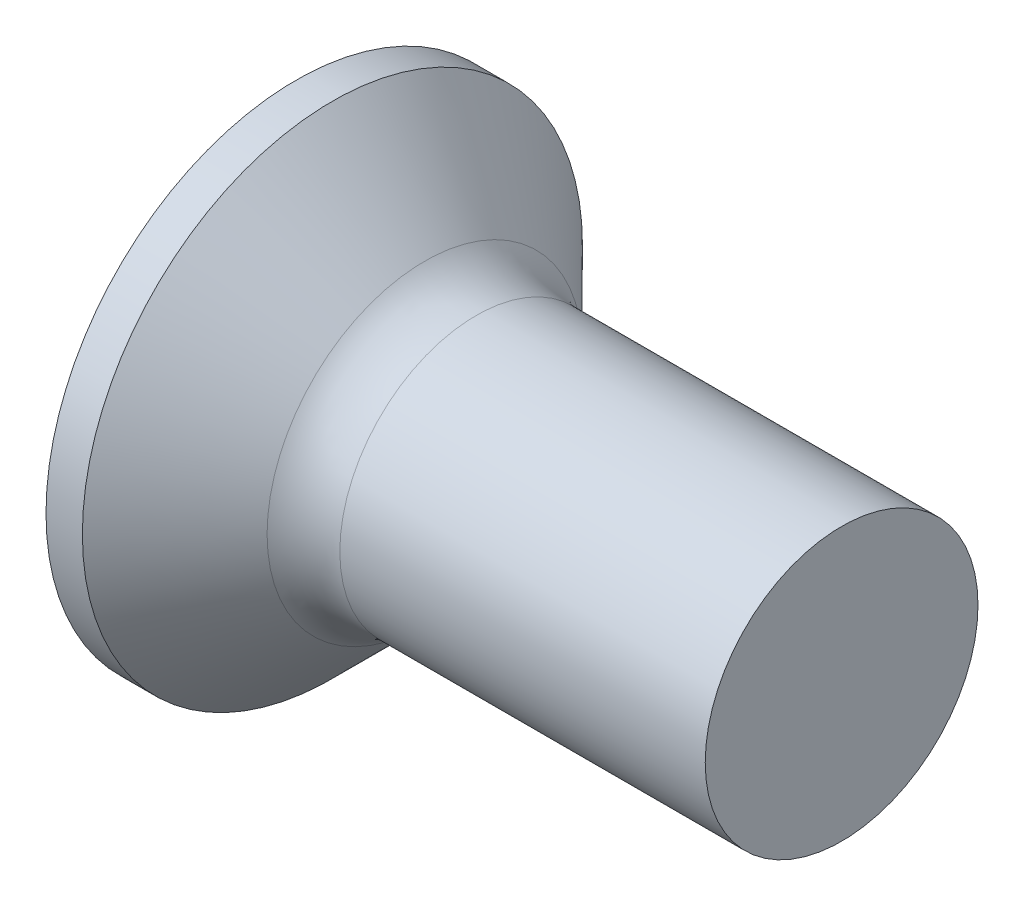
ISO-10303-21;
HEADER;
FILE_DESCRIPTION(('STEP AP214'),'2;1');
FILE_NAME('part.step','',(''),(''),'','','');
FILE_SCHEMA(('AUTOMOTIVE_DESIGN { 1 0 10303 214 1 1 1 1 }'));
ENDSEC;
DATA;
#1=APPLICATION_CONTEXT('core data for automotive mechanical design processes');
#2=APPLICATION_PROTOCOL_DEFINITION('international standard','automotive_design',2000,#1);
#3=PRODUCT_CONTEXT('',#1,'mechanical');
#4=PRODUCT('Part','Part','',(#3));
#5=PRODUCT_RELATED_PRODUCT_CATEGORY('part','',(#4));
#6=PRODUCT_DEFINITION_FORMATION('','',#4);
#7=PRODUCT_DEFINITION_CONTEXT('part definition',#1,'design');
#8=PRODUCT_DEFINITION('design','',#6,#7);
#9=PRODUCT_DEFINITION_SHAPE('','',#8);
#10=(LENGTH_UNIT() NAMED_UNIT(*) SI_UNIT(.MILLI.,.METRE.));
#11=(NAMED_UNIT(*) PLANE_ANGLE_UNIT() SI_UNIT($,.RADIAN.));
#12=(NAMED_UNIT(*) SI_UNIT($,.STERADIAN.) SOLID_ANGLE_UNIT());
#13=UNCERTAINTY_MEASURE_WITH_UNIT(LENGTH_MEASURE(1.E-05),#10,'distance_accuracy_value','');
#14=(GEOMETRIC_REPRESENTATION_CONTEXT(3) GLOBAL_UNCERTAINTY_ASSIGNED_CONTEXT((#13)) GLOBAL_UNIT_ASSIGNED_CONTEXT((#10,
#11,#12)) REPRESENTATION_CONTEXT('',''));
#15=CARTESIAN_POINT('',(0.,0.,0.));
#16=DIRECTION('',(0.,0.,1.));
#17=DIRECTION('',(1.,0.,0.));
#18=AXIS2_PLACEMENT_3D('',#15,#16,#17);
#19=CARTESIAN_POINT('',(0.,0.,0.));
#20=DIRECTION('',(-1.,0.,0.));
#21=DIRECTION('',(0.,0.,1.));
#22=AXIS2_PLACEMENT_3D('',#19,#20,#21);
#23=PLANE('',#22);
#24=CARTESIAN_POINT('',(0.,0.,0.));
#25=DIRECTION('',(-1.,0.,0.));
#26=DIRECTION('',(0.,0.,1.));
#27=AXIS2_PLACEMENT_3D('',#24,#25,#26);
#28=CIRCLE('',#27,2.75);
#29=CARTESIAN_POINT('',(0.,0.,2.75));
#30=VERTEX_POINT('',#29);
#31=EDGE_CURVE('E239',#30,#30,#28,.T.);
#32=ORIENTED_EDGE('',*,*,#31,.T.);
#33=EDGE_LOOP('',(#32));
#34=FACE_BOUND('',#33,.T.);
#35=DIRECTION('',(0.,0.,-1.));
#36=VECTOR('',#35,1.);
#37=CARTESIAN_POINT('',(0.,-0.370000000000005,1.5));
#38=LINE('',#37,#36);
#39=CARTESIAN_POINT('',(0.,-0.370000000000005,1.5));
#40=VERTEX_POINT('',#39);
#41=CARTESIAN_POINT('',(0.,-0.370000000000002,0.590157547916261));
#42=VERTEX_POINT('',#41);
#43=EDGE_CURVE('E329',#40,#42,#38,.T.);
#44=ORIENTED_EDGE('',*,*,#43,.T.);
#45=CARTESIAN_POINT('',(0.,0.,0.));
#46=DIRECTION('',(-1.,0.,0.));
#47=DIRECTION('',(0.,0.,1.));
#48=AXIS2_PLACEMENT_3D('',#45,#46,#47);
#49=CIRCLE('',#48,0.69655289200644);
#50=CARTESIAN_POINT('',(0.,-0.590157547916262,0.37));
#51=VERTEX_POINT('',#50);
#52=EDGE_CURVE('E434',#51,#42,#49,.T.);
#53=ORIENTED_EDGE('',*,*,#52,.F.);
#54=DIRECTION('',(0.,-1.,0.));
#55=VECTOR('',#54,1.);
#56=CARTESIAN_POINT('',(0.,1.5,0.37));
#57=LINE('',#56,#55);
#58=CARTESIAN_POINT('',(0.,-1.5,0.37));
#59=VERTEX_POINT('',#58);
#60=EDGE_CURVE('E290',#51,#59,#57,.T.);
#61=ORIENTED_EDGE('',*,*,#60,.T.);
#62=DIRECTION('',(0.,0.,-1.));
#63=VECTOR('',#62,1.);
#64=CARTESIAN_POINT('',(0.,-1.5,0.37));
#65=LINE('',#64,#63);
#66=CARTESIAN_POINT('',(0.,-1.5,-0.369999999999999));
#67=VERTEX_POINT('',#66);
#68=EDGE_CURVE('E252',#59,#67,#65,.T.);
#69=ORIENTED_EDGE('',*,*,#68,.T.);
#70=DIRECTION('',(0.,1.,0.));
#71=VECTOR('',#70,1.);
#72=CARTESIAN_POINT('',(0.,-1.5,-0.369999999999999));
#73=LINE('',#72,#71);
#74=CARTESIAN_POINT('',(0.,-0.590157547916262,-0.37));
#75=VERTEX_POINT('',#74);
#76=EDGE_CURVE('E284',#67,#75,#73,.T.);
#77=ORIENTED_EDGE('',*,*,#76,.T.);
#78=CARTESIAN_POINT('',(0.,-0.369999999999998,-0.590157547916264));
#79=VERTEX_POINT('',#78);
#80=EDGE_CURVE('E443',#79,#75,#49,.T.);
#81=ORIENTED_EDGE('',*,*,#80,.F.);
#82=CARTESIAN_POINT('',(0.,-0.369999999999995,-1.5));
#83=VERTEX_POINT('',#82);
#84=EDGE_CURVE('E332',#79,#83,#38,.T.);
#85=ORIENTED_EDGE('',*,*,#84,.T.);
#86=DIRECTION('',(0.,1.,0.));
#87=VECTOR('',#86,1.);
#88=CARTESIAN_POINT('',(0.,-0.369999999999995,-1.5));
#89=LINE('',#88,#87);
#90=CARTESIAN_POINT('',(0.,0.370000000000004,-1.5));
#91=VERTEX_POINT('',#90);
#92=EDGE_CURVE('E326',#83,#91,#89,.T.);
#93=ORIENTED_EDGE('',*,*,#92,.T.);
#94=DIRECTION('',(0.,0.,1.));
#95=VECTOR('',#94,1.);
#96=CARTESIAN_POINT('',(0.,0.370000000000004,-1.5));
#97=LINE('',#96,#95);
#98=CARTESIAN_POINT('',(0.,0.370000000000002,-0.590157547916261));
#99=VERTEX_POINT('',#98);
#100=EDGE_CURVE('E322',#91,#99,#97,.T.);
#101=ORIENTED_EDGE('',*,*,#100,.T.);
#102=CARTESIAN_POINT('',(0.,0.590157547916263,-0.369999999999999));
#103=VERTEX_POINT('',#102);
#104=EDGE_CURVE('E438',#103,#99,#49,.T.);
#105=ORIENTED_EDGE('',*,*,#104,.F.);
#106=CARTESIAN_POINT('',(0.,1.5,-0.369999999999999));
#107=VERTEX_POINT('',#106);
#108=EDGE_CURVE('E283',#103,#107,#73,.T.);
#109=ORIENTED_EDGE('',*,*,#108,.T.);
#110=DIRECTION('',(0.,0.,1.));
#111=VECTOR('',#110,1.);
#112=CARTESIAN_POINT('',(0.,1.5,-0.369999999999999));
#113=LINE('',#112,#111);
#114=CARTESIAN_POINT('',(0.,1.5,0.37));
#115=VERTEX_POINT('',#114);
#116=EDGE_CURVE('E286',#107,#115,#113,.T.);
#117=ORIENTED_EDGE('',*,*,#116,.T.);
#118=CARTESIAN_POINT('',(0.,0.590157547916263,0.37));
#119=VERTEX_POINT('',#118);
#120=EDGE_CURVE('E254',#115,#119,#57,.T.);
#121=ORIENTED_EDGE('',*,*,#120,.T.);
#122=CARTESIAN_POINT('',(0.,0.369999999999997,0.590157547916264));
#123=VERTEX_POINT('',#122);
#124=EDGE_CURVE('E437',#123,#119,#49,.T.);
#125=ORIENTED_EDGE('',*,*,#124,.F.);
#126=CARTESIAN_POINT('',(0.,0.369999999999994,1.5));
#127=VERTEX_POINT('',#126);
#128=EDGE_CURVE('E321',#123,#127,#97,.T.);
#129=ORIENTED_EDGE('',*,*,#128,.T.);
#130=DIRECTION('',(0.,-1.,0.));
#131=VECTOR('',#130,1.);
#132=CARTESIAN_POINT('',(0.,0.369999999999994,1.5));
#133=LINE('',#132,#131);
#134=EDGE_CURVE('E325',#127,#40,#133,.T.);
#135=ORIENTED_EDGE('',*,*,#134,.T.);
#136=EDGE_LOOP('',(#44,#53,#61,#69,#77,#81,#85,#93,#101,#105,#109,#117,#121,#125,#129,#135));
#137=FACE_BOUND('',#136,.T.);
#138=ADVANCED_FACE('F39',(#34,#137),#23,.T.);
#139=CARTESIAN_POINT('',(2.01,-0.497851002391851,0.370000000000001));
#140=DIRECTION('',(0.,0.,-1.));
#141=DIRECTION('',(-1.,0.,0.));
#142=AXIS2_PLACEMENT_3D('',#139,#140,#141);
#143=PLANE('',#142);
#144=ORIENTED_EDGE('',*,*,#60,.F.);
#145=CARTESIAN_POINT('',(-1.01053649699026,-0.672102030078459,0.37));
#146=CARTESIAN_POINT('',(-0.799706058781646,-0.65526709888962,0.37));
#147=CARTESIAN_POINT('',(-0.588886212565098,-0.638297110577309,0.37));
#148=CARTESIAN_POINT('',(-0.167272662573758,-0.603984130523452,0.37));
#149=CARTESIAN_POINT('',(0.0435210405937219,-0.586641131327184,0.37));
#150=CARTESIAN_POINT('',(0.465068838236452,-0.551479911668093,0.37));
#151=CARTESIAN_POINT('',(0.675822932725247,-0.533661691368077,0.37));
#152=CARTESIAN_POINT('',(1.09727362087867,-0.497387538868942,0.37));
#153=CARTESIAN_POINT('',(1.30797021528206,-0.478931615293403,0.37));
#154=CARTESIAN_POINT('',(1.67418894765493,-0.446067164114375,0.37));
#155=CARTESIAN_POINT('',(1.82972932594024,-0.431862501020784,0.37));
#156=CARTESIAN_POINT('',(2.14074770367772,-0.402797709732014,0.370000000000001));
#157=CARTESIAN_POINT('',(2.29622570364502,-0.387937587067169,0.370000000000001));
#158=CARTESIAN_POINT('',(2.60710169356699,-0.357305117929345,0.370000000000001));
#159=CARTESIAN_POINT('',(2.76249967848536,-0.341532719782114,0.370000000000001));
#160=CARTESIAN_POINT('',(2.99549070750468,-0.316847908272696,0.370000000000001));
#161=CARTESIAN_POINT('',(3.07313791127142,-0.308448465888146,0.370000000000001));
#162=CARTESIAN_POINT('',(3.22838341584044,-0.291202251038987,0.370000000000001));
#163=CARTESIAN_POINT('',(3.30598171607669,-0.282355473489552,0.370000000000001));
#164=CARTESIAN_POINT('',(3.38354828471668,-0.273232461280213,0.370000000000001));
#165=B_SPLINE_CURVE_WITH_KNOTS('',3,(#145,#146,#147,#148,#149,#150,#151,#152,#153,#154,#155,
#156,#157,#158,#159,#160,#161,#162,#163,#164),.UNSPECIFIED.,.F.,.F.,(4,2,2,2,2,2,2,2,2,4),(0.,
0.634504777580944,1.26902224771403,1.90353950046914,2.53804817608336,3.00661008454961,
3.47516804035678,3.94375256285268,4.17805198347564,4.41235406796206),.UNSPECIFIED.);
#166=CARTESIAN_POINT('',(2.01,-0.415013252800436,0.370000000000001));
#167=VERTEX_POINT('',#166);
#168=EDGE_CURVE('E335',#51,#167,#165,.T.);
#169=ORIENTED_EDGE('',*,*,#168,.T.);
#170=DIRECTION('',(0.,-1.,0.));
#171=VECTOR('',#170,1.);
#172=CARTESIAN_POINT('',(2.01,0.497851002391851,0.37));
#173=LINE('',#172,#171);
#174=CARTESIAN_POINT('',(2.01,-0.497851002391851,0.370000000000001));
#175=VERTEX_POINT('',#174);
#176=EDGE_CURVE('E270',#167,#175,#173,.T.);
#177=ORIENTED_EDGE('',*,*,#176,.T.);
#178=DIRECTION('',(0.894934367749961,0.446197800778958,0.));
#179=VECTOR('',#178,1.);
#180=CARTESIAN_POINT('',(0.,-1.5,0.37));
#181=LINE('',#180,#179);
#182=EDGE_CURVE('E280',#59,#175,#181,.T.);
#183=ORIENTED_EDGE('',*,*,#182,.F.);
#184=EDGE_LOOP('',(#144,#169,#177,#183));
#185=FACE_BOUND('',#184,.T.);
#186=ADVANCED_FACE('F193',(#185),#143,.T.);
#187=CARTESIAN_POINT('',(2.01,0.497851002391851,0.37));
#188=VERTEX_POINT('',#187);
#189=CARTESIAN_POINT('',(2.01,0.415013252800436,0.37));
#190=VERTEX_POINT('',#189);
#191=EDGE_CURVE('E267',#188,#190,#173,.T.);
#192=ORIENTED_EDGE('',*,*,#191,.T.);
#193=CARTESIAN_POINT('',(-1.01053649691082,0.672102030072117,0.369999999999999));
#194=CARTESIAN_POINT('',(-0.799706058711029,0.655267098883947,0.369999999999999));
#195=CARTESIAN_POINT('',(-0.588886212503304,0.638297110572311,0.369999999999999));
#196=CARTESIAN_POINT('',(-0.16727266252961,0.603984130519827,0.37));
#197=CARTESIAN_POINT('',(0.0435210406290474,0.586641131324258,0.37));
#198=CARTESIAN_POINT('',(0.465068838244709,0.551479911667384,0.37));
#199=CARTESIAN_POINT('',(0.67582293271526,0.533661691368909,0.37));
#200=CARTESIAN_POINT('',(1.09727362083221,0.49738753887297,0.37));
#201=CARTESIAN_POINT('',(1.30797021521736,0.478931615299088,0.37));
#202=CARTESIAN_POINT('',(1.67418894757201,0.446067164121905,0.37));
#203=CARTESIAN_POINT('',(1.82972932585734,0.431862501028413,0.37));
#204=CARTESIAN_POINT('',(2.14074770359484,0.402797709739879,0.37));
#205=CARTESIAN_POINT('',(2.29622570356215,0.387937587075169,0.37));
#206=CARTESIAN_POINT('',(2.60710169348415,0.357305117937675,0.370000000000001));
#207=CARTESIAN_POINT('',(2.76249967840253,0.341532719790639,0.370000000000001));
#208=CARTESIAN_POINT('',(2.99549070742189,0.316847908281593,0.370000000000001));
#209=CARTESIAN_POINT('',(3.07313791118864,0.308448465897181,0.370000000000001));
#210=CARTESIAN_POINT('',(3.22838341575769,0.291202251048337,0.370000000000001));
#211=CARTESIAN_POINT('',(3.30598171599396,0.28235547349908,0.370000000000001));
#212=CARTESIAN_POINT('',(3.38354828463398,0.273232461289949,0.370000000000001));
#213=B_SPLINE_CURVE_WITH_KNOTS('',3,(#193,#194,#195,#196,#197,#198,#199,#200,#201,#202,#203,
#204,#205,#206,#207,#208,#209,#210,#211,#212),.UNSPECIFIED.,.F.,.F.,(4,2,2,2,2,2,2,2,2,4),(0.,
0.634504777554396,1.26902224766093,1.90353950036111,2.53804817592041,3.00661008438666,
3.47516804019383,3.94375256268972,4.17805198331267,4.41235406779909),.UNSPECIFIED.);
#214=EDGE_CURVE('E341',#190,#119,#213,.F.);
#215=ORIENTED_EDGE('',*,*,#214,.T.);
#216=ORIENTED_EDGE('',*,*,#120,.F.);
#217=DIRECTION('',(0.89493436774996,-0.446197800778958,0.));
#218=VECTOR('',#217,1.);
#219=CARTESIAN_POINT('',(0.,1.5,0.37));
#220=LINE('',#219,#218);
#221=EDGE_CURVE('E62',#115,#188,#220,.T.);
#222=ORIENTED_EDGE('',*,*,#221,.T.);
#223=EDGE_LOOP('',(#192,#215,#216,#222));
#224=FACE_BOUND('',#223,.T.);
#225=ADVANCED_FACE('F199',(#224),#143,.T.);
#226=CARTESIAN_POINT('',(2.01,0.497851002391851,-0.37));
#227=DIRECTION('',(0.,0.,1.));
#228=DIRECTION('',(0.,-1.,0.));
#229=AXIS2_PLACEMENT_3D('',#226,#227,#228);
#230=PLANE('',#229);
#231=DIRECTION('',(0.,1.,0.));
#232=VECTOR('',#231,1.);
#233=CARTESIAN_POINT('',(2.01,-0.497851002391851,-0.37));
#234=LINE('',#233,#232);
#235=CARTESIAN_POINT('',(2.01,-0.497851002391851,-0.37));
#236=VERTEX_POINT('',#235);
#237=CARTESIAN_POINT('',(2.01,-0.415013252800436,-0.37));
#238=VERTEX_POINT('',#237);
#239=EDGE_CURVE('E257',#236,#238,#234,.T.);
#240=ORIENTED_EDGE('',*,*,#239,.T.);
#241=CARTESIAN_POINT('',(-1.01053649691082,-0.672102030072117,-0.369999999999999));
#242=CARTESIAN_POINT('',(-0.799706058711029,-0.655267098883947,-0.37));
#243=CARTESIAN_POINT('',(-0.588886212503303,-0.638297110572311,-0.37));
#244=CARTESIAN_POINT('',(-0.16727266252961,-0.603984130519827,-0.37));
#245=CARTESIAN_POINT('',(0.0435210406290474,-0.586641131324258,-0.37));
#246=CARTESIAN_POINT('',(0.465068838244709,-0.551479911667384,-0.37));
#247=CARTESIAN_POINT('',(0.67582293271526,-0.533661691368909,-0.37));
#248=CARTESIAN_POINT('',(1.09727362083221,-0.49738753887297,-0.37));
#249=CARTESIAN_POINT('',(1.30797021521736,-0.478931615299089,-0.37));
#250=CARTESIAN_POINT('',(1.67418894757201,-0.446067164121905,-0.37));
#251=CARTESIAN_POINT('',(1.82972932585734,-0.431862501028414,-0.37));
#252=CARTESIAN_POINT('',(2.14074770359484,-0.402797709739879,-0.37));
#253=CARTESIAN_POINT('',(2.29622570356215,-0.387937587075169,-0.37));
#254=CARTESIAN_POINT('',(2.60710169348415,-0.357305117937676,-0.37));
#255=CARTESIAN_POINT('',(2.76249967840253,-0.341532719790639,-0.37));
#256=CARTESIAN_POINT('',(2.99549070742189,-0.316847908281594,-0.37));
#257=CARTESIAN_POINT('',(3.07313791118864,-0.308448465897181,-0.37));
#258=CARTESIAN_POINT('',(3.22838341575769,-0.291202251048338,-0.37));
#259=CARTESIAN_POINT('',(3.30598171599396,-0.282355473499081,-0.37));
#260=CARTESIAN_POINT('',(3.38354828463398,-0.273232461289949,-0.37));
#261=B_SPLINE_CURVE_WITH_KNOTS('',3,(#241,#242,#243,#244,#245,#246,#247,#248,#249,#250,#251,
#252,#253,#254,#255,#256,#257,#258,#259,#260),.UNSPECIFIED.,.F.,.F.,(4,2,2,2,2,2,2,2,2,4),(0.,
0.634504777554396,1.26902224766093,1.90353950036111,2.53804817592041,3.00661008438666,
3.47516804019383,3.94375256268972,4.17805198331267,4.41235406779909),.UNSPECIFIED.);
#262=EDGE_CURVE('E390',#238,#75,#261,.F.);
#263=ORIENTED_EDGE('',*,*,#262,.T.);
#264=ORIENTED_EDGE('',*,*,#76,.F.);
#265=DIRECTION('',(0.89493436774996,0.446197800778958,0.));
#266=VECTOR('',#265,1.);
#267=CARTESIAN_POINT('',(0.,-1.5,-0.369999999999999));
#268=LINE('',#267,#266);
#269=EDGE_CURVE('E277',#67,#236,#268,.T.);
#270=ORIENTED_EDGE('',*,*,#269,.T.);
#271=EDGE_LOOP('',(#240,#263,#264,#270));
#272=FACE_BOUND('',#271,.T.);
#273=ADVANCED_FACE('F395',(#272),#230,.T.);
#274=ORIENTED_EDGE('',*,*,#108,.F.);
#275=CARTESIAN_POINT('',(-1.01053649699026,0.672102030078459,-0.369999999999999));
#276=CARTESIAN_POINT('',(-0.799706058781647,0.65526709888962,-0.369999999999999));
#277=CARTESIAN_POINT('',(-0.588886212565098,0.638297110577309,-0.369999999999999));
#278=CARTESIAN_POINT('',(-0.167272662573758,0.603984130523452,-0.369999999999999));
#279=CARTESIAN_POINT('',(0.0435210405937223,0.586641131327184,-0.369999999999999));
#280=CARTESIAN_POINT('',(0.465068838236453,0.551479911668094,-0.37));
#281=CARTESIAN_POINT('',(0.675822932725247,0.533661691368078,-0.37));
#282=CARTESIAN_POINT('',(1.09727362087867,0.497387538868942,-0.37));
#283=CARTESIAN_POINT('',(1.30797021528206,0.478931615293403,-0.37));
#284=CARTESIAN_POINT('',(1.67418894765493,0.446067164114375,-0.37));
#285=CARTESIAN_POINT('',(1.82972932594024,0.431862501020785,-0.37));
#286=CARTESIAN_POINT('',(2.14074770367772,0.402797709732015,-0.37));
#287=CARTESIAN_POINT('',(2.29622570364502,0.387937587067169,-0.37));
#288=CARTESIAN_POINT('',(2.60710169356699,0.357305117929345,-0.37));
#289=CARTESIAN_POINT('',(2.76249967848536,0.341532719782115,-0.37));
#290=CARTESIAN_POINT('',(2.99549070750468,0.316847908272697,-0.37));
#291=CARTESIAN_POINT('',(3.07313791127142,0.308448465888147,-0.37));
#292=CARTESIAN_POINT('',(3.22838341584044,0.291202251038988,-0.37));
#293=CARTESIAN_POINT('',(3.30598171607669,0.282355473489552,-0.37));
#294=CARTESIAN_POINT('',(3.38354828471668,0.273232461280214,-0.37));
#295=B_SPLINE_CURVE_WITH_KNOTS('',3,(#275,#276,#277,#278,#279,#280,#281,#282,#283,#284,#285,
#286,#287,#288,#289,#290,#291,#292,#293,#294),.UNSPECIFIED.,.F.,.F.,(4,2,2,2,2,2,2,2,2,4),(0.,
0.634504777580944,1.26902224771403,1.90353950046914,2.53804817608336,3.00661008454961,
3.47516804035678,3.94375256285268,4.17805198347564,4.41235406796206),.UNSPECIFIED.);
#296=CARTESIAN_POINT('',(2.01,0.415013252800436,-0.37));
#297=VERTEX_POINT('',#296);
#298=EDGE_CURVE('E385',#103,#297,#295,.T.);
#299=ORIENTED_EDGE('',*,*,#298,.T.);
#300=CARTESIAN_POINT('',(2.01,0.497851002391851,-0.37));
#301=VERTEX_POINT('',#300);
#302=EDGE_CURVE('E261',#297,#301,#234,.T.);
#303=ORIENTED_EDGE('',*,*,#302,.T.);
#304=DIRECTION('',(0.89493436774996,-0.446197800778958,0.));
#305=VECTOR('',#304,1.);
#306=CARTESIAN_POINT('',(0.,1.5,-0.369999999999999));
#307=LINE('',#306,#305);
#308=EDGE_CURVE('E265',#107,#301,#307,.T.);
#309=ORIENTED_EDGE('',*,*,#308,.F.);
#310=EDGE_LOOP('',(#274,#299,#303,#309));
#311=FACE_BOUND('',#310,.T.);
#312=ADVANCED_FACE('F398',(#311),#230,.T.);
#313=CARTESIAN_POINT('',(2.01,-0.497851002391851,-0.37));
#314=DIRECTION('',(-1.,0.,0.));
#315=DIRECTION('',(0.,0.,1.));
#316=AXIS2_PLACEMENT_3D('',#313,#314,#315);
#317=PLANE('',#316);
#318=DIRECTION('',(0.,-1.,0.));
#319=VECTOR('',#318,1.);
#320=CARTESIAN_POINT('',(2.01,0.369999999999998,0.497851002391852));
#321=LINE('',#320,#319);
#322=CARTESIAN_POINT('',(2.01,-0.247548741498374,0.49785100239185));
#323=VERTEX_POINT('',#322);
#324=CARTESIAN_POINT('',(2.01,-0.370000000000002,0.49785100239185));
#325=VERTEX_POINT('',#324);
#326=EDGE_CURVE('E296',#323,#325,#321,.T.);
#327=ORIENTED_EDGE('',*,*,#326,.F.);
#328=CARTESIAN_POINT('',(2.01,0.,0.));
#329=DIRECTION('',(-1.,0.,0.));
#330=DIRECTION('',(0.,0.,1.));
#331=AXIS2_PLACEMENT_3D('',#328,#329,#330);
#332=CIRCLE('',#331,0.555999999999999);
#333=CARTESIAN_POINT('',(2.01,-0.370000000000002,0.415013252800434));
#334=VERTEX_POINT('',#333);
#335=EDGE_CURVE('E54',#334,#323,#332,.T.);
#336=ORIENTED_EDGE('',*,*,#335,.F.);
#337=DIRECTION('',(0.,0.,-1.));
#338=VECTOR('',#337,1.);
#339=CARTESIAN_POINT('',(2.01,-0.370000000000002,0.497851002391849));
#340=LINE('',#339,#338);
#341=EDGE_CURVE('E303',#325,#334,#340,.T.);
#342=ORIENTED_EDGE('',*,*,#341,.F.);
#343=EDGE_LOOP('',(#327,#336,#342));
#344=FACE_BOUND('',#343,.T.);
#345=ADVANCED_FACE('F206',(#344),#317,.T.);
#346=ORIENTED_EDGE('',*,*,#176,.F.);
#347=CARTESIAN_POINT('',(2.01,-0.49785100239185,0.247548741498373));
#348=VERTEX_POINT('',#347);
#349=EDGE_CURVE('E464',#348,#167,#332,.T.);
#350=ORIENTED_EDGE('',*,*,#349,.F.);
#351=DIRECTION('',(0.,0.,-1.));
#352=VECTOR('',#351,1.);
#353=CARTESIAN_POINT('',(2.01,-0.497851002391851,0.370000000000001));
#354=LINE('',#353,#352);
#355=EDGE_CURVE('E262',#175,#348,#354,.T.);
#356=ORIENTED_EDGE('',*,*,#355,.F.);
#357=EDGE_LOOP('',(#346,#350,#356));
#358=FACE_BOUND('',#357,.T.);
#359=ADVANCED_FACE('F462',(#358),#317,.T.);
#360=CARTESIAN_POINT('',(2.01,-0.49785100239185,-0.247548741498373));
#361=VERTEX_POINT('',#360);
#362=EDGE_CURVE('E266',#361,#236,#354,.T.);
#363=ORIENTED_EDGE('',*,*,#362,.F.);
#364=EDGE_CURVE('E474',#238,#361,#332,.T.);
#365=ORIENTED_EDGE('',*,*,#364,.F.);
#366=ORIENTED_EDGE('',*,*,#239,.F.);
#367=EDGE_LOOP('',(#363,#365,#366));
#368=FACE_BOUND('',#367,.T.);
#369=ADVANCED_FACE('F472',(#368),#317,.T.);
#370=CARTESIAN_POINT('',(2.01,-0.369999999999999,-0.415013252800437));
#371=VERTEX_POINT('',#370);
#372=CARTESIAN_POINT('',(2.01,-0.369999999999999,-0.497851002391852));
#373=VERTEX_POINT('',#372);
#374=EDGE_CURVE('E306',#371,#373,#340,.T.);
#375=ORIENTED_EDGE('',*,*,#374,.F.);
#376=CARTESIAN_POINT('',(2.01,-0.247548741498372,-0.497851002391851));
#377=VERTEX_POINT('',#376);
#378=EDGE_CURVE('E477',#377,#371,#332,.T.);
#379=ORIENTED_EDGE('',*,*,#378,.F.);
#380=DIRECTION('',(0.,1.,0.));
#381=VECTOR('',#380,1.);
#382=CARTESIAN_POINT('',(2.01,-0.369999999999999,-0.497851002391852));
#383=LINE('',#382,#381);
#384=EDGE_CURVE('E298',#373,#377,#383,.T.);
#385=ORIENTED_EDGE('',*,*,#384,.F.);
#386=EDGE_LOOP('',(#375,#379,#385));
#387=FACE_BOUND('',#386,.T.);
#388=ADVANCED_FACE('F506',(#387),#317,.T.);
#389=CARTESIAN_POINT('',(2.01,0.247548741498374,-0.49785100239185));
#390=VERTEX_POINT('',#389);
#391=CARTESIAN_POINT('',(2.01,0.370000000000002,-0.497851002391849));
#392=VERTEX_POINT('',#391);
#393=EDGE_CURVE('E302',#390,#392,#383,.T.);
#394=ORIENTED_EDGE('',*,*,#393,.F.);
#395=CARTESIAN_POINT('',(2.01,0.370000000000002,-0.415013252800435));
#396=VERTEX_POINT('',#395);
#397=EDGE_CURVE('E432',#396,#390,#332,.T.);
#398=ORIENTED_EDGE('',*,*,#397,.F.);
#399=DIRECTION('',(0.,0.,1.));
#400=VECTOR('',#399,1.);
#401=CARTESIAN_POINT('',(2.01,0.370000000000002,-0.497851002391849));
#402=LINE('',#401,#400);
#403=EDGE_CURVE('E293',#392,#396,#402,.T.);
#404=ORIENTED_EDGE('',*,*,#403,.F.);
#405=EDGE_LOOP('',(#394,#398,#404));
#406=FACE_BOUND('',#405,.T.);
#407=ADVANCED_FACE('F502',(#406),#317,.T.);
#408=ORIENTED_EDGE('',*,*,#302,.F.);
#409=CARTESIAN_POINT('',(2.01,0.497851002391851,-0.247548741498373));
#410=VERTEX_POINT('',#409);
#411=EDGE_CURVE('E424',#410,#297,#332,.T.);
#412=ORIENTED_EDGE('',*,*,#411,.F.);
#413=DIRECTION('',(0.,0.,1.));
#414=VECTOR('',#413,1.);
#415=CARTESIAN_POINT('',(2.01,0.497851002391851,-0.37));
#416=LINE('',#415,#414);
#417=EDGE_CURVE('E271',#301,#410,#416,.T.);
#418=ORIENTED_EDGE('',*,*,#417,.F.);
#419=EDGE_LOOP('',(#408,#412,#418));
#420=FACE_BOUND('',#419,.T.);
#421=ADVANCED_FACE('F422',(#420),#317,.T.);
#422=CARTESIAN_POINT('',(2.01,0.497851002391851,0.247548741498373));
#423=VERTEX_POINT('',#422);
#424=EDGE_CURVE('E260',#423,#188,#416,.T.);
#425=ORIENTED_EDGE('',*,*,#424,.F.);
#426=EDGE_CURVE('E431',#190,#423,#332,.T.);
#427=ORIENTED_EDGE('',*,*,#426,.F.);
#428=ORIENTED_EDGE('',*,*,#191,.F.);
#429=EDGE_LOOP('',(#425,#427,#428));
#430=FACE_BOUND('',#429,.T.);
#431=ADVANCED_FACE('F496',(#430),#317,.T.);
#432=CARTESIAN_POINT('',(2.01,0.369999999999999,0.415013252800437));
#433=VERTEX_POINT('',#432);
#434=CARTESIAN_POINT('',(2.01,0.369999999999998,0.497851002391852));
#435=VERTEX_POINT('',#434);
#436=EDGE_CURVE('E297',#433,#435,#402,.T.);
#437=ORIENTED_EDGE('',*,*,#436,.F.);
#438=CARTESIAN_POINT('',(2.01,0.247548741498371,0.497851002391852));
#439=VERTEX_POINT('',#438);
#440=EDGE_CURVE('E433',#439,#433,#332,.T.);
#441=ORIENTED_EDGE('',*,*,#440,.F.);
#442=EDGE_CURVE('E307',#435,#439,#321,.T.);
#443=ORIENTED_EDGE('',*,*,#442,.F.);
#444=EDGE_LOOP('',(#437,#441,#443));
#445=FACE_BOUND('',#444,.T.);
#446=ADVANCED_FACE('F412',(#445),#317,.T.);
#447=CARTESIAN_POINT('',(0.,-1.5,-0.369999999999999));
#448=DIRECTION('',(-0.446197800778958,0.89493436774996,0.));
#449=DIRECTION('',(-0.89493436774996,-0.446197800778958,0.));
#450=AXIS2_PLACEMENT_3D('',#447,#448,#449);
#451=PLANE('',#450);
#452=ORIENTED_EDGE('',*,*,#355,.T.);
#453=CARTESIAN_POINT('',(2.86902882959523,-0.0695550419463993,0.));
#454=DIRECTION('',(-0.446197800778958,0.89493436774996,0.));
#455=DIRECTION('',(-0.89493436774996,-0.446197800778958,0.));
#456=AXIS2_PLACEMENT_3D('',#453,#454,#455);
#457=ELLIPSE('',#456,1.11145965245249,0.491029028347017);
#458=EDGE_CURVE('E466',#348,#361,#457,.F.);
#459=ORIENTED_EDGE('',*,*,#458,.T.);
#460=ORIENTED_EDGE('',*,*,#362,.T.);
#461=ORIENTED_EDGE('',*,*,#269,.F.);
#462=ORIENTED_EDGE('',*,*,#68,.F.);
#463=ORIENTED_EDGE('',*,*,#182,.T.);
#464=EDGE_LOOP('',(#452,#459,#460,#461,#462,#463));
#465=FACE_BOUND('',#464,.T.);
#466=ADVANCED_FACE('F404',(#465),#451,.T.);
#467=CARTESIAN_POINT('',(2.01,0.497851002391851,0.37));
#468=DIRECTION('',(-0.446197800778958,-0.89493436774996,0.));
#469=DIRECTION('',(0.89493436774996,-0.446197800778958,0.));
#470=AXIS2_PLACEMENT_3D('',#467,#468,#469);
#471=PLANE('',#470);
#472=ORIENTED_EDGE('',*,*,#417,.T.);
#473=CARTESIAN_POINT('',(2.86902882959523,0.0695550419463989,0.));
#474=DIRECTION('',(-0.446197800778958,-0.89493436774996,0.));
#475=DIRECTION('',(-0.89493436774996,0.446197800778958,0.));
#476=AXIS2_PLACEMENT_3D('',#473,#474,#475);
#477=ELLIPSE('',#476,1.11145965245249,0.491029028347017);
#478=EDGE_CURVE('E416',#410,#423,#477,.F.);
#479=ORIENTED_EDGE('',*,*,#478,.T.);
#480=ORIENTED_EDGE('',*,*,#424,.T.);
#481=ORIENTED_EDGE('',*,*,#221,.F.);
#482=ORIENTED_EDGE('',*,*,#116,.F.);
#483=ORIENTED_EDGE('',*,*,#308,.T.);
#484=EDGE_LOOP('',(#472,#479,#480,#481,#482,#483));
#485=FACE_BOUND('',#484,.T.);
#486=ADVANCED_FACE('F400',(#485),#471,.T.);
#487=CARTESIAN_POINT('',(2.01,-0.369999999999999,-0.497851002391852));
#488=DIRECTION('',(0.,1.,0.));
#489=DIRECTION('',(-1.,0.,0.));
#490=AXIS2_PLACEMENT_3D('',#487,#488,#489);
#491=PLANE('',#490);
#492=ORIENTED_EDGE('',*,*,#84,.F.);
#493=CARTESIAN_POINT('',(-1.01053649691082,-0.369999999999997,-0.672102030072118));
#494=CARTESIAN_POINT('',(-0.799706058711029,-0.369999999999997,-0.655267098883948));
#495=CARTESIAN_POINT('',(-0.588886212503303,-0.369999999999997,-0.638297110572312));
#496=CARTESIAN_POINT('',(-0.16727266252961,-0.369999999999998,-0.603984130519829));
#497=CARTESIAN_POINT('',(0.0435210406290476,-0.369999999999998,-0.586641131324259));
#498=CARTESIAN_POINT('',(0.465068838244709,-0.369999999999998,-0.551479911667386));
#499=CARTESIAN_POINT('',(0.67582293271526,-0.369999999999998,-0.53366169136891));
#500=CARTESIAN_POINT('',(1.09727362083221,-0.369999999999998,-0.497387538872971));
#501=CARTESIAN_POINT('',(1.30797021521736,-0.369999999999999,-0.47893161529909));
#502=CARTESIAN_POINT('',(1.67418894757201,-0.369999999999999,-0.446067164121906));
#503=CARTESIAN_POINT('',(1.82972932585734,-0.369999999999999,-0.431862501028414));
#504=CARTESIAN_POINT('',(2.14074770359484,-0.369999999999999,-0.40279770973988));
#505=CARTESIAN_POINT('',(2.29622570356215,-0.369999999999999,-0.38793758707517));
#506=CARTESIAN_POINT('',(2.60710169348415,-0.369999999999999,-0.357305117937676));
#507=CARTESIAN_POINT('',(2.76249967840253,-0.37,-0.34153271979064));
#508=CARTESIAN_POINT('',(2.99549070742189,-0.37,-0.316847908281594));
#509=CARTESIAN_POINT('',(3.07313791118864,-0.37,-0.308448465897182));
#510=CARTESIAN_POINT('',(3.22838341575769,-0.37,-0.291202251048339));
#511=CARTESIAN_POINT('',(3.30598171599396,-0.37,-0.282355473499082));
#512=CARTESIAN_POINT('',(3.38354828463398,-0.37,-0.27323246128995));
#513=B_SPLINE_CURVE_WITH_KNOTS('',3,(#493,#494,#495,#496,#497,#498,#499,#500,#501,#502,#503,
#504,#505,#506,#507,#508,#509,#510,#511,#512),.UNSPECIFIED.,.F.,.F.,(4,2,2,2,2,2,2,2,2,4),(0.,
0.634504777554396,1.26902224766093,1.90353950036111,2.53804817592041,3.00661008438666,
3.47516804019383,3.94375256268972,4.17805198331267,4.41235406779909),.UNSPECIFIED.);
#514=EDGE_CURVE('E378',#79,#371,#513,.T.);
#515=ORIENTED_EDGE('',*,*,#514,.T.);
#516=ORIENTED_EDGE('',*,*,#374,.T.);
#517=DIRECTION('',(0.894934367749961,0.,0.446197800778958));
#518=VECTOR('',#517,1.);
#519=CARTESIAN_POINT('',(0.,-0.369999999999995,-1.5));
#520=LINE('',#519,#518);
#521=EDGE_CURVE('E318',#83,#373,#520,.T.);
#522=ORIENTED_EDGE('',*,*,#521,.F.);
#523=EDGE_LOOP('',(#492,#515,#516,#522));
#524=FACE_BOUND('',#523,.T.);
#525=ADVANCED_FACE('F403',(#524),#491,.T.);
#526=CARTESIAN_POINT('',(2.01,0.369999999999998,0.497851002391852));
#527=DIRECTION('',(0.,-1.,0.));
#528=DIRECTION('',(0.,0.,-1.));
#529=AXIS2_PLACEMENT_3D('',#526,#527,#528);
#530=PLANE('',#529);
#531=ORIENTED_EDGE('',*,*,#403,.T.);
#532=CARTESIAN_POINT('',(-1.01053649691082,0.370000000000002,-0.672102030072116));
#533=CARTESIAN_POINT('',(-0.799706058711029,0.370000000000002,-0.655267098883946));
#534=CARTESIAN_POINT('',(-0.588886212503304,0.370000000000002,-0.638297110572309));
#535=CARTESIAN_POINT('',(-0.16727266252961,0.370000000000002,-0.603984130519826));
#536=CARTESIAN_POINT('',(0.0435210406290474,0.370000000000002,-0.586641131324257));
#537=CARTESIAN_POINT('',(0.465068838244709,0.370000000000002,-0.551479911667383));
#538=CARTESIAN_POINT('',(0.67582293271526,0.370000000000002,-0.533661691368907));
#539=CARTESIAN_POINT('',(1.09727362083221,0.370000000000002,-0.497387538872969));
#540=CARTESIAN_POINT('',(1.30797021521736,0.370000000000002,-0.478931615299087));
#541=CARTESIAN_POINT('',(1.67418894757201,0.370000000000002,-0.446067164121903));
#542=CARTESIAN_POINT('',(1.82972932585734,0.370000000000002,-0.431862501028412));
#543=CARTESIAN_POINT('',(2.14074770359484,0.370000000000001,-0.402797709739878));
#544=CARTESIAN_POINT('',(2.29622570356215,0.370000000000001,-0.387937587075168));
#545=CARTESIAN_POINT('',(2.60710169348415,0.370000000000001,-0.357305117937674));
#546=CARTESIAN_POINT('',(2.76249967840253,0.370000000000001,-0.341532719790638));
#547=CARTESIAN_POINT('',(2.99549070742189,0.370000000000001,-0.316847908281592));
#548=CARTESIAN_POINT('',(3.07313791118864,0.370000000000001,-0.30844846589718));
#549=CARTESIAN_POINT('',(3.22838341575769,0.370000000000001,-0.291202251048337));
#550=CARTESIAN_POINT('',(3.30598171599396,0.370000000000001,-0.28235547349908));
#551=CARTESIAN_POINT('',(3.38354828463398,0.370000000000001,-0.273232461289948));
#552=B_SPLINE_CURVE_WITH_KNOTS('',3,(#532,#533,#534,#535,#536,#537,#538,#539,#540,#541,#542,
#543,#544,#545,#546,#547,#548,#549,#550,#551),.UNSPECIFIED.,.F.,.F.,(4,2,2,2,2,2,2,2,2,4),(0.,
0.634504777554396,1.26902224766093,1.90353950036111,2.53804817592041,3.00661008438666,
3.47516804019383,3.94375256268972,4.17805198331267,4.41235406779909),.UNSPECIFIED.);
#553=EDGE_CURVE('E372',#396,#99,#552,.F.);
#554=ORIENTED_EDGE('',*,*,#553,.T.);
#555=ORIENTED_EDGE('',*,*,#100,.F.);
#556=DIRECTION('',(0.89493436774996,0.,0.446197800778958));
#557=VECTOR('',#556,1.);
#558=CARTESIAN_POINT('',(0.,0.370000000000004,-1.5));
#559=LINE('',#558,#557);
#560=EDGE_CURVE('E315',#91,#392,#559,.T.);
#561=ORIENTED_EDGE('',*,*,#560,.T.);
#562=EDGE_LOOP('',(#531,#554,#555,#561));
#563=FACE_BOUND('',#562,.T.);
#564=ADVANCED_FACE('F409',(#563),#530,.T.);
#565=CARTESIAN_POINT('',(0.,0.370000000000004,-1.5));
#566=DIRECTION('',(-0.446197800778958,0.,0.89493436774996));
#567=DIRECTION('',(-0.89493436774996,0.,-0.446197800778958));
#568=AXIS2_PLACEMENT_3D('',#565,#566,#567);
#569=PLANE('',#568);
#570=ORIENTED_EDGE('',*,*,#384,.T.);
#571=CARTESIAN_POINT('',(2.86902882959523,0.,-0.0695550419463993));
#572=DIRECTION('',(-0.446197800778958,0.,0.89493436774996));
#573=DIRECTION('',(-0.89493436774996,0.,-0.446197800778958));
#574=AXIS2_PLACEMENT_3D('',#571,#572,#573);
#575=ELLIPSE('',#574,1.11145965245249,0.491029028347017);
#576=EDGE_CURVE('E520',#377,#390,#575,.F.);
#577=ORIENTED_EDGE('',*,*,#576,.T.);
#578=ORIENTED_EDGE('',*,*,#393,.T.);
#579=ORIENTED_EDGE('',*,*,#560,.F.);
#580=ORIENTED_EDGE('',*,*,#92,.F.);
#581=ORIENTED_EDGE('',*,*,#521,.T.);
#582=EDGE_LOOP('',(#570,#577,#578,#579,#580,#581));
#583=FACE_BOUND('',#582,.T.);
#584=ADVANCED_FACE('F351',(#583),#569,.T.);
#585=ORIENTED_EDGE('',*,*,#341,.T.);
#586=CARTESIAN_POINT('',(-1.01053649699026,-0.370000000000002,0.672102030078457));
#587=CARTESIAN_POINT('',(-0.799706058781647,-0.370000000000002,0.655267098889619));
#588=CARTESIAN_POINT('',(-0.588886212565098,-0.370000000000002,0.638297110577308));
#589=CARTESIAN_POINT('',(-0.167272662573758,-0.370000000000002,0.603984130523451));
#590=CARTESIAN_POINT('',(0.0435210405937219,-0.370000000000002,0.586641131327183));
#591=CARTESIAN_POINT('',(0.465068838236452,-0.370000000000002,0.551479911668092));
#592=CARTESIAN_POINT('',(0.675822932725247,-0.370000000000002,0.533661691368076));
#593=CARTESIAN_POINT('',(1.09727362087867,-0.370000000000002,0.497387538868941));
#594=CARTESIAN_POINT('',(1.30797021528206,-0.370000000000002,0.478931615293402));
#595=CARTESIAN_POINT('',(1.67418894765493,-0.370000000000002,0.446067164114374));
#596=CARTESIAN_POINT('',(1.82972932594024,-0.370000000000002,0.431862501020783));
#597=CARTESIAN_POINT('',(2.14074770367772,-0.370000000000002,0.402797709732013));
#598=CARTESIAN_POINT('',(2.29622570364502,-0.370000000000002,0.387937587067168));
#599=CARTESIAN_POINT('',(2.60710169356699,-0.370000000000002,0.357305117929344));
#600=CARTESIAN_POINT('',(2.76249967848536,-0.370000000000002,0.341532719782113));
#601=CARTESIAN_POINT('',(2.99549070750468,-0.370000000000002,0.316847908272695));
#602=CARTESIAN_POINT('',(3.07313791127142,-0.370000000000002,0.308448465888145));
#603=CARTESIAN_POINT('',(3.22838341584044,-0.370000000000002,0.291202251038986));
#604=CARTESIAN_POINT('',(3.30598171607669,-0.370000000000002,0.28235547348955));
#605=CARTESIAN_POINT('',(3.38354828471668,-0.370000000000002,0.273232461280212));
#606=B_SPLINE_CURVE_WITH_KNOTS('',3,(#586,#587,#588,#589,#590,#591,#592,#593,#594,#595,#596,
#597,#598,#599,#600,#601,#602,#603,#604,#605),.UNSPECIFIED.,.F.,.F.,(4,2,2,2,2,2,2,2,2,4),(0.,
0.634504777580944,1.26902224771403,1.90353950046914,2.53804817608336,3.00661008454961,
3.47516804035678,3.94375256285268,4.17805198347564,4.41235406796205),.UNSPECIFIED.);
#607=EDGE_CURVE('E365',#334,#42,#606,.F.);
#608=ORIENTED_EDGE('',*,*,#607,.T.);
#609=ORIENTED_EDGE('',*,*,#43,.F.);
#610=DIRECTION('',(0.89493436774996,0.,-0.446197800778958));
#611=VECTOR('',#610,1.);
#612=CARTESIAN_POINT('',(0.,-0.370000000000005,1.5));
#613=LINE('',#612,#611);
#614=EDGE_CURVE('E312',#40,#325,#613,.T.);
#615=ORIENTED_EDGE('',*,*,#614,.T.);
#616=EDGE_LOOP('',(#585,#608,#609,#615));
#617=FACE_BOUND('',#616,.T.);
#618=ADVANCED_FACE('F411',(#617),#491,.T.);
#619=ORIENTED_EDGE('',*,*,#128,.F.);
#620=CARTESIAN_POINT('',(-1.01053649691082,0.369999999999997,0.672102030072119));
#621=CARTESIAN_POINT('',(-0.799706058711028,0.369999999999997,0.655267098883948));
#622=CARTESIAN_POINT('',(-0.588886212503303,0.369999999999997,0.638297110572312));
#623=CARTESIAN_POINT('',(-0.16727266252961,0.369999999999997,0.603984130519829));
#624=CARTESIAN_POINT('',(0.0435210406290477,0.369999999999997,0.586641131324259));
#625=CARTESIAN_POINT('',(0.465068838244709,0.369999999999998,0.551479911667386));
#626=CARTESIAN_POINT('',(0.67582293271526,0.369999999999998,0.53366169136891));
#627=CARTESIAN_POINT('',(1.09727362083221,0.369999999999998,0.497387538872972));
#628=CARTESIAN_POINT('',(1.30797021521736,0.369999999999998,0.47893161529909));
#629=CARTESIAN_POINT('',(1.67418894757201,0.369999999999998,0.446067164121906));
#630=CARTESIAN_POINT('',(1.82972932585734,0.369999999999998,0.431862501028415));
#631=CARTESIAN_POINT('',(2.14074770359484,0.369999999999998,0.402797709739881));
#632=CARTESIAN_POINT('',(2.29622570356215,0.369999999999999,0.387937587075171));
#633=CARTESIAN_POINT('',(2.60710169348415,0.369999999999999,0.357305117937677));
#634=CARTESIAN_POINT('',(2.76249967840253,0.369999999999999,0.34153271979064));
#635=CARTESIAN_POINT('',(2.99549070742189,0.369999999999999,0.316847908281595));
#636=CARTESIAN_POINT('',(3.07313791118864,0.369999999999999,0.308448465897183));
#637=CARTESIAN_POINT('',(3.22838341575769,0.369999999999999,0.29120225104834));
#638=CARTESIAN_POINT('',(3.30598171599396,0.369999999999999,0.282355473499083));
#639=CARTESIAN_POINT('',(3.38354828463398,0.369999999999999,0.273232461289951));
#640=B_SPLINE_CURVE_WITH_KNOTS('',3,(#620,#621,#622,#623,#624,#625,#626,#627,#628,#629,#630,
#631,#632,#633,#634,#635,#636,#637,#638,#639),.UNSPECIFIED.,.F.,.F.,(4,2,2,2,2,2,2,2,2,4),(0.,
0.634504777554396,1.26902224766093,1.90353950036111,2.53804817592041,3.00661008438666,
3.47516804019383,3.94375256268972,4.17805198331267,4.41235406779909),.UNSPECIFIED.);
#641=EDGE_CURVE('E356',#123,#433,#640,.T.);
#642=ORIENTED_EDGE('',*,*,#641,.T.);
#643=ORIENTED_EDGE('',*,*,#436,.T.);
#644=DIRECTION('',(0.89493436774996,0.,-0.446197800778958));
#645=VECTOR('',#644,1.);
#646=CARTESIAN_POINT('',(0.,0.369999999999994,1.5));
#647=LINE('',#646,#645);
#648=EDGE_CURVE('E301',#127,#435,#647,.T.);
#649=ORIENTED_EDGE('',*,*,#648,.F.);
#650=EDGE_LOOP('',(#619,#642,#643,#649));
#651=FACE_BOUND('',#650,.T.);
#652=ADVANCED_FACE('F226',(#651),#530,.T.);
#653=CARTESIAN_POINT('',(2.01,-0.370000000000002,0.497851002391849));
#654=DIRECTION('',(-0.446197800778958,0.,-0.89493436774996));
#655=DIRECTION('',(0.89493436774996,0.,-0.446197800778958));
#656=AXIS2_PLACEMENT_3D('',#653,#654,#655);
#657=PLANE('',#656);
#658=ORIENTED_EDGE('',*,*,#442,.T.);
#659=CARTESIAN_POINT('',(2.86902882959523,0.,0.0695550419463989));
#660=DIRECTION('',(-0.446197800778958,0.,-0.89493436774996));
#661=DIRECTION('',(-0.89493436774996,0.,0.446197800778958));
#662=AXIS2_PLACEMENT_3D('',#659,#660,#661);
#663=ELLIPSE('',#662,1.11145965245249,0.491029028347017);
#664=EDGE_CURVE('E11',#439,#323,#663,.F.);
#665=ORIENTED_EDGE('',*,*,#664,.T.);
#666=ORIENTED_EDGE('',*,*,#326,.T.);
#667=ORIENTED_EDGE('',*,*,#614,.F.);
#668=ORIENTED_EDGE('',*,*,#134,.F.);
#669=ORIENTED_EDGE('',*,*,#648,.T.);
#670=EDGE_LOOP('',(#658,#665,#666,#667,#668,#669));
#671=FACE_BOUND('',#670,.T.);
#672=ADVANCED_FACE('F221',(#671),#657,.T.);
#673=CARTESIAN_POINT('',(6.,1.5,0.));
#674=DIRECTION('',(1.,0.,0.));
#675=DIRECTION('',(0.,0.,-1.));
#676=AXIS2_PLACEMENT_3D('',#673,#674,#675);
#677=PLANE('',#676);
#678=CARTESIAN_POINT('',(6.,0.,0.));
#679=DIRECTION('',(-1.,0.,0.));
#680=DIRECTION('',(0.,0.,1.));
#681=AXIS2_PLACEMENT_3D('',#678,#679,#680);
#682=CIRCLE('',#681,1.5);
#683=CARTESIAN_POINT('',(6.,0.,1.5));
#684=VERTEX_POINT('',#683);
#685=EDGE_CURVE('E231',#684,#684,#682,.T.);
#686=ORIENTED_EDGE('',*,*,#685,.F.);
#687=EDGE_LOOP('',(#686));
#688=FACE_BOUND('',#687,.T.);
#689=ADVANCED_FACE('F218',(#688),#677,.T.);
#690=CARTESIAN_POINT('',(-6.34999999999999,0.,0.));
#691=DIRECTION('',(-1.,0.,0.));
#692=DIRECTION('',(0.,0.,1.));
#693=AXIS2_PLACEMENT_3D('',#690,#691,#692);
#694=CYLINDRICAL_SURFACE('',#693,1.5);
#695=CARTESIAN_POINT('',(1.98137084989848,0.,0.));
#696=DIRECTION('',(-1.,0.,0.));
#697=DIRECTION('',(0.,0.,1.));
#698=AXIS2_PLACEMENT_3D('',#695,#696,#697);
#699=CIRCLE('',#698,1.5);
#700=CARTESIAN_POINT('',(1.98137084989848,0.,1.5));
#701=VERTEX_POINT('',#700);
#702=EDGE_CURVE('E47',#701,#701,#699,.F.);
#703=ORIENTED_EDGE('',*,*,#702,.T.);
#704=EDGE_LOOP('',(#703));
#705=FACE_BOUND('',#704,.T.);
#706=ORIENTED_EDGE('',*,*,#685,.T.);
#707=EDGE_LOOP('',(#706));
#708=FACE_BOUND('',#707,.T.);
#709=ADVANCED_FACE('F215',(#705,#708),#694,.T.);
#710=CARTESIAN_POINT('',(0.400000000000005,0.,0.));
#711=DIRECTION('',(-1.,0.,0.));
#712=DIRECTION('',(0.,0.,1.));
#713=AXIS2_PLACEMENT_3D('',#710,#711,#712);
#714=CONICAL_SURFACE('',#713,2.75,0.78539816339745);
#715=CARTESIAN_POINT('',(1.41568542494924,0.,0.));
#716=DIRECTION('',(-1.,0.,0.));
#717=DIRECTION('',(0.,0.,1.));
#718=AXIS2_PLACEMENT_3D('',#715,#716,#717);
#719=CIRCLE('',#718,1.73431457505076);
#720=CARTESIAN_POINT('',(1.41568542494924,0.,1.73431457505076));
#721=VERTEX_POINT('',#720);
#722=EDGE_CURVE('E233',#721,#721,#719,.T.);
#723=ORIENTED_EDGE('',*,*,#722,.T.);
#724=EDGE_LOOP('',(#723));
#725=FACE_BOUND('',#724,.T.);
#726=CARTESIAN_POINT('',(0.400000000000005,0.,0.));
#727=DIRECTION('',(-1.,0.,0.));
#728=DIRECTION('',(0.,0.,1.));
#729=AXIS2_PLACEMENT_3D('',#726,#727,#728);
#730=CIRCLE('',#729,2.75);
#731=CARTESIAN_POINT('',(0.400000000000005,0.,2.75));
#732=VERTEX_POINT('',#731);
#733=EDGE_CURVE('E234',#732,#732,#730,.T.);
#734=ORIENTED_EDGE('',*,*,#733,.F.);
#735=EDGE_LOOP('',(#734));
#736=FACE_BOUND('',#735,.T.);
#737=ADVANCED_FACE('F211',(#725,#736),#714,.T.);
#738=CARTESIAN_POINT('',(-6.34999999999999,0.,0.));
#739=DIRECTION('',(-1.,0.,0.));
#740=DIRECTION('',(0.,0.,1.));
#741=AXIS2_PLACEMENT_3D('',#738,#739,#740);
#742=CYLINDRICAL_SURFACE('',#741,2.75);
#743=ORIENTED_EDGE('',*,*,#733,.T.);
#744=EDGE_LOOP('',(#743));
#745=FACE_BOUND('',#744,.T.);
#746=ORIENTED_EDGE('',*,*,#31,.F.);
#747=EDGE_LOOP('',(#746));
#748=FACE_BOUND('',#747,.T.);
#749=ADVANCED_FACE('F208',(#745,#748),#742,.T.);
#750=CARTESIAN_POINT('',(1.98137084989848,0.,0.));
#751=DIRECTION('',(-1.,0.,0.));
#752=DIRECTION('',(0.,0.,1.));
#753=AXIS2_PLACEMENT_3D('',#750,#751,#752);
#754=TOROIDAL_SURFACE('',#753,2.3,0.8);
#755=ORIENTED_EDGE('',*,*,#702,.F.);
#756=EDGE_LOOP('',(#755));
#757=FACE_BOUND('',#756,.T.);
#758=ORIENTED_EDGE('',*,*,#722,.F.);
#759=EDGE_LOOP('',(#758));
#760=FACE_BOUND('',#759,.T.);
#761=ADVANCED_FACE('F41',(#757,#760),#754,.F.);
#762=CARTESIAN_POINT('',(2.01,0.,0.));
#763=DIRECTION('',(-1.,0.,0.));
#764=DIRECTION('',(0.,0.,1.));
#765=AXIS2_PLACEMENT_3D('',#762,#763,#764);
#766=CONICAL_SURFACE('',#765,0.555999999999999,0.069813170079766);
#767=ORIENTED_EDGE('',*,*,#52,.T.);
#768=ORIENTED_EDGE('',*,*,#607,.F.);
#769=EDGE_CURVE('E478',#167,#334,#332,.T.);
#770=ORIENTED_EDGE('',*,*,#769,.F.);
#771=ORIENTED_EDGE('',*,*,#168,.F.);
#772=EDGE_LOOP('',(#767,#768,#770,#771));
#773=FACE_BOUND('',#772,.T.);
#774=ADVANCED_FACE('F190',(#773),#766,.F.);
#775=EDGE_CURVE('E435',#433,#190,#332,.T.);
#776=ORIENTED_EDGE('',*,*,#775,.F.);
#777=ORIENTED_EDGE('',*,*,#641,.F.);
#778=ORIENTED_EDGE('',*,*,#124,.T.);
#779=ORIENTED_EDGE('',*,*,#214,.F.);
#780=EDGE_LOOP('',(#776,#777,#778,#779));
#781=FACE_BOUND('',#780,.T.);
#782=ADVANCED_FACE('F490',(#781),#766,.F.);
#783=EDGE_CURVE('E475',#371,#238,#332,.T.);
#784=ORIENTED_EDGE('',*,*,#783,.F.);
#785=ORIENTED_EDGE('',*,*,#514,.F.);
#786=ORIENTED_EDGE('',*,*,#80,.T.);
#787=ORIENTED_EDGE('',*,*,#262,.F.);
#788=EDGE_LOOP('',(#784,#785,#786,#787));
#789=FACE_BOUND('',#788,.T.);
#790=ADVANCED_FACE('F449',(#789),#766,.F.);
#791=ORIENTED_EDGE('',*,*,#104,.T.);
#792=ORIENTED_EDGE('',*,*,#553,.F.);
#793=EDGE_CURVE('E429',#297,#396,#332,.T.);
#794=ORIENTED_EDGE('',*,*,#793,.F.);
#795=ORIENTED_EDGE('',*,*,#298,.F.);
#796=EDGE_LOOP('',(#791,#792,#794,#795));
#797=FACE_BOUND('',#796,.T.);
#798=ADVANCED_FACE('F534',(#797),#766,.F.);
#799=EDGE_CURVE('E476',#361,#348,#332,.T.);
#800=ORIENTED_EDGE('',*,*,#799,.F.);
#801=ORIENTED_EDGE('',*,*,#458,.F.);
#802=EDGE_LOOP('',(#800,#801));
#803=FACE_BOUND('',#802,.T.);
#804=ADVANCED_FACE('F538',(#803),#766,.F.);
#805=EDGE_CURVE('E428',#423,#410,#332,.T.);
#806=ORIENTED_EDGE('',*,*,#805,.F.);
#807=ORIENTED_EDGE('',*,*,#478,.F.);
#808=EDGE_LOOP('',(#806,#807));
#809=FACE_BOUND('',#808,.T.);
#810=ADVANCED_FACE('F543',(#809),#766,.F.);
#811=EDGE_CURVE('E551',#390,#377,#332,.T.);
#812=ORIENTED_EDGE('',*,*,#811,.F.);
#813=ORIENTED_EDGE('',*,*,#576,.F.);
#814=EDGE_LOOP('',(#812,#813));
#815=FACE_BOUND('',#814,.T.);
#816=ADVANCED_FACE('F187',(#815),#766,.F.);
#817=EDGE_CURVE('E436',#323,#439,#332,.T.);
#818=ORIENTED_EDGE('',*,*,#817,.F.);
#819=ORIENTED_EDGE('',*,*,#664,.F.);
#820=EDGE_LOOP('',(#818,#819));
#821=FACE_BOUND('',#820,.T.);
#822=ADVANCED_FACE('F182',(#821),#766,.F.);
#823=CARTESIAN_POINT('',(2.19065535110549,0.,0.));
#824=DIRECTION('',(-1.,0.,0.));
#825=DIRECTION('',(0.,0.,1.));
#826=AXIS2_PLACEMENT_3D('',#823,#824,#825);
#827=CONICAL_SURFACE('',#826,0.,1.25663706143592);
#828=ORIENTED_EDGE('',*,*,#440,.T.);
#829=ORIENTED_EDGE('',*,*,#775,.T.);
#830=ORIENTED_EDGE('',*,*,#426,.T.);
#831=ORIENTED_EDGE('',*,*,#805,.T.);
#832=ORIENTED_EDGE('',*,*,#411,.T.);
#833=ORIENTED_EDGE('',*,*,#793,.T.);
#834=ORIENTED_EDGE('',*,*,#397,.T.);
#835=ORIENTED_EDGE('',*,*,#811,.T.);
#836=ORIENTED_EDGE('',*,*,#378,.T.);
#837=ORIENTED_EDGE('',*,*,#783,.T.);
#838=ORIENTED_EDGE('',*,*,#364,.T.);
#839=ORIENTED_EDGE('',*,*,#799,.T.);
#840=ORIENTED_EDGE('',*,*,#349,.T.);
#841=ORIENTED_EDGE('',*,*,#769,.T.);
#842=ORIENTED_EDGE('',*,*,#335,.T.);
#843=ORIENTED_EDGE('',*,*,#817,.T.);
#844=EDGE_LOOP('',(#828,#829,#830,#831,#832,#833,#834,#835,#836,#837,#838,#839,#840,#841,#842,#843));
#845=FACE_BOUND('',#844,.T.);
#846=CARTESIAN_POINT('',(2.19065535110549,0.,0.));
#847=VERTEX_POINT('',#846);
#848=VERTEX_LOOP('',#847);
#849=FACE_BOUND('',#848,.T.);
#850=ADVANCED_FACE('F180',(#845,#849),#827,.F.);
#851=CLOSED_SHELL('',(#138,#186,#225,#273,#312,#345,#359,#369,#388,#407,#421,#431,#446,#466,
#486,#525,#564,#584,#618,#652,#672,#689,#709,#737,#749,#761,#774,#782,#790,#798,#804,#810,#816,
#822,#850));
#852=MANIFOLD_SOLID_BREP('B2',#851);
#853=ADVANCED_BREP_SHAPE_REPRESENTATION('',(#18,#852),#14);
#854=SHAPE_DEFINITION_REPRESENTATION(#9,#853);
ENDSEC;
END-ISO-10303-21;
